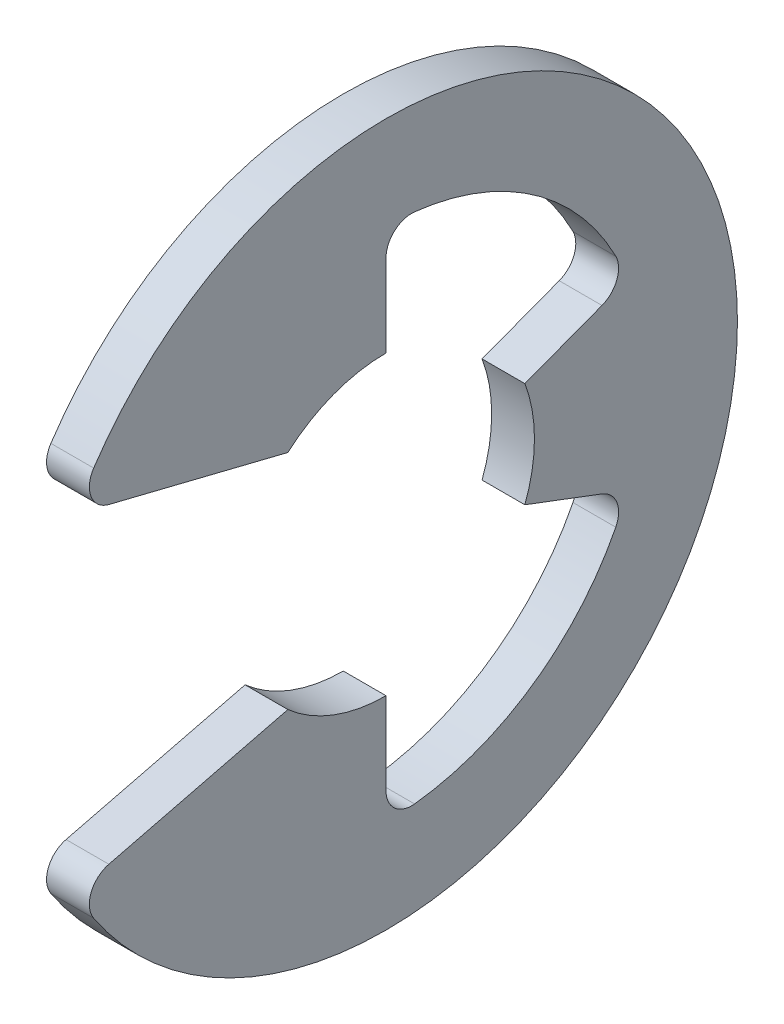
ISO-10303-21;
HEADER;
FILE_DESCRIPTION(('STEP AP214'),'2;1');
FILE_NAME('part.step','',(''),(''),'','','');
FILE_SCHEMA(('AUTOMOTIVE_DESIGN { 1 0 10303 214 1 1 1 1 }'));
ENDSEC;
DATA;
#1=APPLICATION_CONTEXT('core data for automotive mechanical design processes');
#2=APPLICATION_PROTOCOL_DEFINITION('international standard','automotive_design',2000,#1);
#3=PRODUCT_CONTEXT('',#1,'mechanical');
#4=PRODUCT('Part','Part','',(#3));
#5=PRODUCT_RELATED_PRODUCT_CATEGORY('part','',(#4));
#6=PRODUCT_DEFINITION_FORMATION('','',#4);
#7=PRODUCT_DEFINITION_CONTEXT('part definition',#1,'design');
#8=PRODUCT_DEFINITION('design','',#6,#7);
#9=PRODUCT_DEFINITION_SHAPE('','',#8);
#10=(LENGTH_UNIT() NAMED_UNIT(*) SI_UNIT(.MILLI.,.METRE.));
#11=(NAMED_UNIT(*) PLANE_ANGLE_UNIT() SI_UNIT($,.RADIAN.));
#12=(NAMED_UNIT(*) SI_UNIT($,.STERADIAN.) SOLID_ANGLE_UNIT());
#13=UNCERTAINTY_MEASURE_WITH_UNIT(LENGTH_MEASURE(1.E-05),#10,'distance_accuracy_value','');
#14=(GEOMETRIC_REPRESENTATION_CONTEXT(3) GLOBAL_UNCERTAINTY_ASSIGNED_CONTEXT((#13)) GLOBAL_UNIT_ASSIGNED_CONTEXT((#10,
#11,#12)) REPRESENTATION_CONTEXT('',''));
#15=CARTESIAN_POINT('',(0.,0.,0.));
#16=DIRECTION('',(0.,0.,1.));
#17=DIRECTION('',(1.,0.,0.));
#18=AXIS2_PLACEMENT_3D('',#15,#16,#17);
#19=CARTESIAN_POINT('',(0.6,0.,0.));
#20=DIRECTION('',(-1.,0.,0.));
#21=DIRECTION('',(0.,0.,1.));
#22=AXIS2_PLACEMENT_3D('',#19,#20,#21);
#23=CYLINDRICAL_SURFACE('',#22,9.85);
#24=CARTESIAN_POINT('',(0.6,0.,0.));
#25=DIRECTION('',(1.,0.,0.));
#26=DIRECTION('',(0.,0.,-1.));
#27=AXIS2_PLACEMENT_3D('',#24,#25,#26);
#28=CIRCLE('',#27,9.85);
#29=CARTESIAN_POINT('',(0.6,-5.46408430032092,8.19550381361552));
#30=VERTEX_POINT('',#29);
#31=CARTESIAN_POINT('',(0.6,5.46408430032092,8.19550381361552));
#32=VERTEX_POINT('',#31);
#33=EDGE_CURVE('E170',#30,#32,#28,.T.);
#34=ORIENTED_EDGE('',*,*,#33,.F.);
#35=DIRECTION('',(-1.,0.,0.));
#36=VECTOR('',#35,1.);
#37=CARTESIAN_POINT('',(0.6,-5.46408430032092,8.19550381361552));
#38=LINE('',#37,#36);
#39=CARTESIAN_POINT('',(-0.6,-5.46408430032092,8.19550381361552));
#40=VERTEX_POINT('',#39);
#41=EDGE_CURVE('E264',#30,#40,#38,.T.);
#42=ORIENTED_EDGE('',*,*,#41,.T.);
#43=CARTESIAN_POINT('',(-0.6,0.,0.));
#44=DIRECTION('',(1.,0.,0.));
#45=DIRECTION('',(0.,0.,-1.));
#46=AXIS2_PLACEMENT_3D('',#43,#44,#45);
#47=CIRCLE('',#46,9.85);
#48=CARTESIAN_POINT('',(-0.6,5.46408430032092,8.19550381361552));
#49=VERTEX_POINT('',#48);
#50=EDGE_CURVE('E208',#40,#49,#47,.T.);
#51=ORIENTED_EDGE('',*,*,#50,.T.);
#52=DIRECTION('',(-1.,0.,0.));
#53=VECTOR('',#52,1.);
#54=CARTESIAN_POINT('',(0.6,5.46408430032092,8.19550381361552));
#55=LINE('',#54,#53);
#56=EDGE_CURVE('E262',#49,#32,#55,.F.);
#57=ORIENTED_EDGE('',*,*,#56,.T.);
#58=EDGE_LOOP('',(#34,#42,#51,#57));
#59=FACE_BOUND('',#58,.T.);
#60=ADVANCED_FACE('F32',(#59),#23,.T.);
#61=CARTESIAN_POINT('',(0.6,4.59934516724939,8.7102539591277));
#62=DIRECTION('',(0.,0.970536829925373,-0.240952820606873));
#63=DIRECTION('',(0.,0.240952820606873,0.970536829925373));
#64=AXIS2_PLACEMENT_3D('',#61,#62,#63);
#65=PLANE('',#64);
#66=DIRECTION('',(0.,-0.240952820606873,-0.970536829925373));
#67=VECTOR('',#66,1.);
#68=CARTESIAN_POINT('',(0.6,4.59934516724939,8.7102539591277));
#69=LINE('',#68,#67);
#70=CARTESIAN_POINT('',(0.6,4.36589263594916,7.76992763675671));
#71=VERTEX_POINT('',#70);
#72=CARTESIAN_POINT('',(0.6,3.12,2.75158136350718));
#73=VERTEX_POINT('',#72);
#74=EDGE_CURVE('E156',#71,#73,#69,.T.);
#75=ORIENTED_EDGE('',*,*,#74,.F.);
#76=DIRECTION('',(-1.,0.,0.));
#77=VECTOR('',#76,1.);
#78=CARTESIAN_POINT('',(0.6,4.36589263594916,7.76992763675671));
#79=LINE('',#78,#77);
#80=CARTESIAN_POINT('',(-0.6,4.36589263594916,7.76992763675671));
#81=VERTEX_POINT('',#80);
#82=EDGE_CURVE('E276',#71,#81,#79,.T.);
#83=ORIENTED_EDGE('',*,*,#82,.T.);
#84=DIRECTION('',(0.,-0.240952820606873,-0.970536829925373));
#85=VECTOR('',#84,1.);
#86=CARTESIAN_POINT('',(-0.6,4.59934516724939,8.7102539591277));
#87=LINE('',#86,#85);
#88=CARTESIAN_POINT('',(-0.6,3.12,2.75158136350718));
#89=VERTEX_POINT('',#88);
#90=EDGE_CURVE('E176',#81,#89,#87,.T.);
#91=ORIENTED_EDGE('',*,*,#90,.T.);
#92=DIRECTION('',(-1.,0.,0.));
#93=VECTOR('',#92,1.);
#94=CARTESIAN_POINT('',(0.6,3.12,2.75158136350718));
#95=LINE('',#94,#93);
#96=EDGE_CURVE('E173',#73,#89,#95,.T.);
#97=ORIENTED_EDGE('',*,*,#96,.F.);
#98=EDGE_LOOP('',(#75,#83,#91,#97));
#99=FACE_BOUND('',#98,.T.);
#100=ADVANCED_FACE('F174',(#99),#65,.F.);
#101=CARTESIAN_POINT('',(0.6,0.,0.));
#102=DIRECTION('',(-1.,0.,0.));
#103=DIRECTION('',(0.,0.,1.));
#104=AXIS2_PLACEMENT_3D('',#101,#102,#103);
#105=CYLINDRICAL_SURFACE('',#104,4.16);
#106=CARTESIAN_POINT('',(-0.6,0.,0.));
#107=DIRECTION('',(-1.,0.,0.));
#108=DIRECTION('',(0.,0.,1.));
#109=AXIS2_PLACEMENT_3D('',#106,#107,#108);
#110=CIRCLE('',#109,4.16);
#111=CARTESIAN_POINT('',(-0.6,4.16,0.));
#112=VERTEX_POINT('',#111);
#113=EDGE_CURVE('E212',#89,#112,#110,.T.);
#114=ORIENTED_EDGE('',*,*,#113,.T.);
#115=DIRECTION('',(-1.,0.,0.));
#116=VECTOR('',#115,1.);
#117=CARTESIAN_POINT('',(0.6,4.16,0.));
#118=LINE('',#117,#116);
#119=CARTESIAN_POINT('',(0.6,4.16,0.));
#120=VERTEX_POINT('',#119);
#121=EDGE_CURVE('E180',#120,#112,#118,.T.);
#122=ORIENTED_EDGE('',*,*,#121,.F.);
#123=CARTESIAN_POINT('',(0.6,0.,0.));
#124=DIRECTION('',(-1.,0.,0.));
#125=DIRECTION('',(0.,0.,1.));
#126=AXIS2_PLACEMENT_3D('',#123,#124,#125);
#127=CIRCLE('',#126,4.16);
#128=EDGE_CURVE('E162',#73,#120,#127,.T.);
#129=ORIENTED_EDGE('',*,*,#128,.F.);
#130=ORIENTED_EDGE('',*,*,#96,.T.);
#131=EDGE_LOOP('',(#114,#122,#129,#130));
#132=FACE_BOUND('',#131,.T.);
#133=ADVANCED_FACE('F182',(#132),#105,.F.);
#134=CARTESIAN_POINT('',(0.6,4.16,0.));
#135=DIRECTION('',(0.,0.,1.));
#136=DIRECTION('',(0.,-1.,0.));
#137=AXIS2_PLACEMENT_3D('',#134,#135,#136);
#138=PLANE('',#137);
#139=DIRECTION('',(0.,1.,0.));
#140=VECTOR('',#139,1.);
#141=CARTESIAN_POINT('',(-0.6,4.16,0.));
#142=LINE('',#141,#140);
#143=CARTESIAN_POINT('',(-0.6,6.4710355381905,0.));
#144=VERTEX_POINT('',#143);
#145=EDGE_CURVE('E214',#112,#144,#142,.T.);
#146=ORIENTED_EDGE('',*,*,#145,.T.);
#147=DIRECTION('',(1.,0.,0.));
#148=VECTOR('',#147,1.);
#149=CARTESIAN_POINT('',(0.6,6.4710355381905,0.));
#150=LINE('',#149,#148);
#151=CARTESIAN_POINT('',(0.6,6.4710355381905,0.));
#152=VERTEX_POINT('',#151);
#153=EDGE_CURVE('E260',#144,#152,#150,.T.);
#154=ORIENTED_EDGE('',*,*,#153,.T.);
#155=DIRECTION('',(0.,1.,0.));
#156=VECTOR('',#155,1.);
#157=CARTESIAN_POINT('',(0.6,4.16,0.));
#158=LINE('',#157,#156);
#159=EDGE_CURVE('E185',#120,#152,#158,.T.);
#160=ORIENTED_EDGE('',*,*,#159,.F.);
#161=ORIENTED_EDGE('',*,*,#121,.T.);
#162=EDGE_LOOP('',(#146,#154,#160,#161));
#163=FACE_BOUND('',#162,.T.);
#164=ADVANCED_FACE('F382',(#163),#138,.F.);
#165=CARTESIAN_POINT('',(0.6,0.,0.));
#166=DIRECTION('',(-1.,0.,0.));
#167=DIRECTION('',(0.,0.,1.));
#168=AXIS2_PLACEMENT_3D('',#165,#166,#167);
#169=CYLINDRICAL_SURFACE('',#168,7.23096774193548);
#170=CARTESIAN_POINT('',(0.6,0.,0.));
#171=DIRECTION('',(-1.,0.,0.));
#172=DIRECTION('',(0.,0.,-1.));
#173=AXIS2_PLACEMENT_3D('',#170,#171,#172);
#174=CIRCLE('',#173,7.23096774193548);
#175=CARTESIAN_POINT('',(0.6,7.18661972969076,-0.799619500594528));
#176=VERTEX_POINT('',#175);
#177=CARTESIAN_POINT('',(0.6,3.28882932508869,-6.4397590137635));
#178=VERTEX_POINT('',#177);
#179=EDGE_CURVE('E187',#176,#178,#174,.T.);
#180=ORIENTED_EDGE('',*,*,#179,.F.);
#181=DIRECTION('',(-1.,0.,0.));
#182=VECTOR('',#181,1.);
#183=CARTESIAN_POINT('',(0.6,7.18661972969076,-0.799619500594528));
#184=LINE('',#183,#182);
#185=CARTESIAN_POINT('',(-0.6,7.18661972969076,-0.799619500594528));
#186=VERTEX_POINT('',#185);
#187=EDGE_CURVE('E257',#176,#186,#184,.T.);
#188=ORIENTED_EDGE('',*,*,#187,.T.);
#189=CARTESIAN_POINT('',(-0.6,0.,0.));
#190=DIRECTION('',(-1.,0.,0.));
#191=DIRECTION('',(0.,0.,-1.));
#192=AXIS2_PLACEMENT_3D('',#189,#190,#191);
#193=CIRCLE('',#192,7.23096774193548);
#194=CARTESIAN_POINT('',(-0.6,3.28882932508869,-6.4397590137635));
#195=VERTEX_POINT('',#194);
#196=EDGE_CURVE('E217',#186,#195,#193,.T.);
#197=ORIENTED_EDGE('',*,*,#196,.T.);
#198=DIRECTION('',(-1.,0.,0.));
#199=VECTOR('',#198,1.);
#200=CARTESIAN_POINT('',(0.6,3.28882932508869,-6.4397590137635));
#201=LINE('',#200,#199);
#202=EDGE_CURVE('E255',#195,#178,#201,.F.);
#203=ORIENTED_EDGE('',*,*,#202,.T.);
#204=EDGE_LOOP('',(#180,#188,#197,#203));
#205=FACE_BOUND('',#204,.T.);
#206=ADVANCED_FACE('F304',(#205),#169,.F.);
#207=CARTESIAN_POINT('',(0.6,1.47078210486802,-3.8913236822449));
#208=DIRECTION('',(0.,-0.935414346693485,-0.353553390593275));
#209=DIRECTION('',(0.,0.353553390593275,-0.935414346693485));
#210=AXIS2_PLACEMENT_3D('',#207,#208,#209);
#211=PLANE('',#210);
#212=DIRECTION('',(0.,-0.353553390593275,0.935414346693485));
#213=VECTOR('',#212,1.);
#214=CARTESIAN_POINT('',(0.6,1.47078210486802,-3.8913236822449));
#215=LINE('',#214,#213);
#216=CARTESIAN_POINT('',(0.6,2.28785655517683,-6.0530994803868));
#217=VERTEX_POINT('',#216);
#218=CARTESIAN_POINT('',(0.6,1.47078210486802,-3.8913236822449));
#219=VERTEX_POINT('',#218);
#220=EDGE_CURVE('E192',#217,#219,#215,.T.);
#221=ORIENTED_EDGE('',*,*,#220,.F.);
#222=DIRECTION('',(1.,0.,0.));
#223=VECTOR('',#222,1.);
#224=CARTESIAN_POINT('',(-0.6,2.28785655517683,-6.0530994803868));
#225=LINE('',#224,#223);
#226=CARTESIAN_POINT('',(-0.6,2.28785655517683,-6.0530994803868));
#227=VERTEX_POINT('',#226);
#228=EDGE_CURVE('E279',#217,#227,#225,.F.);
#229=ORIENTED_EDGE('',*,*,#228,.T.);
#230=DIRECTION('',(0.,-0.353553390593275,0.935414346693485));
#231=VECTOR('',#230,1.);
#232=CARTESIAN_POINT('',(-0.6,1.47078210486802,-3.8913236822449));
#233=LINE('',#232,#231);
#234=CARTESIAN_POINT('',(-0.6,1.47078210486802,-3.8913236822449));
#235=VERTEX_POINT('',#234);
#236=EDGE_CURVE('E220',#227,#235,#233,.T.);
#237=ORIENTED_EDGE('',*,*,#236,.T.);
#238=DIRECTION('',(-1.,0.,0.));
#239=VECTOR('',#238,1.);
#240=CARTESIAN_POINT('',(0.6,1.47078210486802,-3.8913236822449));
#241=LINE('',#240,#239);
#242=EDGE_CURVE('E244',#219,#235,#241,.T.);
#243=ORIENTED_EDGE('',*,*,#242,.F.);
#244=EDGE_LOOP('',(#221,#229,#237,#243));
#245=FACE_BOUND('',#244,.T.);
#246=ADVANCED_FACE('F307',(#245),#211,.F.);
#247=CARTESIAN_POINT('',(0.6,0.,0.));
#248=DIRECTION('',(-1.,0.,0.));
#249=DIRECTION('',(0.,0.,1.));
#250=AXIS2_PLACEMENT_3D('',#247,#248,#249);
#251=CYLINDRICAL_SURFACE('',#250,4.16);
#252=CARTESIAN_POINT('',(-0.6,0.,0.));
#253=DIRECTION('',(-1.,0.,0.));
#254=DIRECTION('',(0.,0.,1.));
#255=AXIS2_PLACEMENT_3D('',#252,#253,#254);
#256=CIRCLE('',#255,4.16);
#257=CARTESIAN_POINT('',(-0.6,-1.47078210486802,-3.8913236822449));
#258=VERTEX_POINT('',#257);
#259=EDGE_CURVE('E222',#235,#258,#256,.T.);
#260=ORIENTED_EDGE('',*,*,#259,.T.);
#261=DIRECTION('',(-1.,0.,0.));
#262=VECTOR('',#261,1.);
#263=CARTESIAN_POINT('',(0.6,-1.47078210486802,-3.8913236822449));
#264=LINE('',#263,#262);
#265=CARTESIAN_POINT('',(0.6,-1.47078210486802,-3.8913236822449));
#266=VERTEX_POINT('',#265);
#267=EDGE_CURVE('E241',#266,#258,#264,.T.);
#268=ORIENTED_EDGE('',*,*,#267,.F.);
#269=CARTESIAN_POINT('',(0.6,0.,0.));
#270=DIRECTION('',(-1.,0.,0.));
#271=DIRECTION('',(0.,0.,1.));
#272=AXIS2_PLACEMENT_3D('',#269,#270,#271);
#273=CIRCLE('',#272,4.16);
#274=EDGE_CURVE('E194',#219,#266,#273,.T.);
#275=ORIENTED_EDGE('',*,*,#274,.F.);
#276=ORIENTED_EDGE('',*,*,#242,.T.);
#277=EDGE_LOOP('',(#260,#268,#275,#276));
#278=FACE_BOUND('',#277,.T.);
#279=ADVANCED_FACE('F313',(#278),#251,.F.);
#280=CARTESIAN_POINT('',(0.6,-1.47078210486802,-3.8913236822449));
#281=DIRECTION('',(0.,0.935414346693485,-0.353553390593275));
#282=DIRECTION('',(0.,0.353553390593275,0.935414346693485));
#283=AXIS2_PLACEMENT_3D('',#280,#281,#282);
#284=PLANE('',#283);
#285=DIRECTION('',(0.,-0.353553390593274,-0.935414346693485));
#286=VECTOR('',#285,1.);
#287=CARTESIAN_POINT('',(-0.6,-1.47078210486802,-3.8913236822449));
#288=LINE('',#287,#286);
#289=CARTESIAN_POINT('',(-0.6,-2.28785655517682,-6.0530994803868));
#290=VERTEX_POINT('',#289);
#291=EDGE_CURVE('E224',#258,#290,#288,.T.);
#292=ORIENTED_EDGE('',*,*,#291,.T.);
#293=DIRECTION('',(1.,0.,0.));
#294=VECTOR('',#293,1.);
#295=CARTESIAN_POINT('',(0.6,-2.28785655517682,-6.0530994803868));
#296=LINE('',#295,#294);
#297=CARTESIAN_POINT('',(0.6,-2.28785655517682,-6.0530994803868));
#298=VERTEX_POINT('',#297);
#299=EDGE_CURVE('E47',#290,#298,#296,.T.);
#300=ORIENTED_EDGE('',*,*,#299,.T.);
#301=DIRECTION('',(0.,-0.353553390593274,-0.935414346693485));
#302=VECTOR('',#301,1.);
#303=CARTESIAN_POINT('',(0.6,-1.47078210486802,-3.8913236822449));
#304=LINE('',#303,#302);
#305=EDGE_CURVE('E196',#266,#298,#304,.T.);
#306=ORIENTED_EDGE('',*,*,#305,.F.);
#307=ORIENTED_EDGE('',*,*,#267,.T.);
#308=EDGE_LOOP('',(#292,#300,#306,#307));
#309=FACE_BOUND('',#308,.T.);
#310=ADVANCED_FACE('F315',(#309),#284,.F.);
#311=CARTESIAN_POINT('',(0.6,0.,0.));
#312=DIRECTION('',(-1.,0.,0.));
#313=DIRECTION('',(0.,0.,1.));
#314=AXIS2_PLACEMENT_3D('',#311,#312,#313);
#315=CYLINDRICAL_SURFACE('',#314,7.23096774193548);
#316=CARTESIAN_POINT('',(-0.6,0.,0.));
#317=DIRECTION('',(-1.,0.,0.));
#318=DIRECTION('',(0.,0.,-1.));
#319=AXIS2_PLACEMENT_3D('',#316,#317,#318);
#320=CIRCLE('',#319,7.23096774193548);
#321=CARTESIAN_POINT('',(-0.6,-3.28882932508869,-6.4397590137635));
#322=VERTEX_POINT('',#321);
#323=CARTESIAN_POINT('',(-0.6,-7.18661972969076,-0.799619500594529));
#324=VERTEX_POINT('',#323);
#325=EDGE_CURVE('E226',#322,#324,#320,.T.);
#326=ORIENTED_EDGE('',*,*,#325,.T.);
#327=DIRECTION('',(-1.,0.,0.));
#328=VECTOR('',#327,1.);
#329=CARTESIAN_POINT('',(0.6,-7.18661972969076,-0.799619500594529));
#330=LINE('',#329,#328);
#331=CARTESIAN_POINT('',(0.6,-7.18661972969076,-0.799619500594529));
#332=VERTEX_POINT('',#331);
#333=EDGE_CURVE('E253',#324,#332,#330,.F.);
#334=ORIENTED_EDGE('',*,*,#333,.T.);
#335=CARTESIAN_POINT('',(0.6,0.,0.));
#336=DIRECTION('',(-1.,0.,0.));
#337=DIRECTION('',(0.,0.,-1.));
#338=AXIS2_PLACEMENT_3D('',#335,#336,#337);
#339=CIRCLE('',#338,7.23096774193548);
#340=CARTESIAN_POINT('',(0.6,-3.28882932508869,-6.4397590137635));
#341=VERTEX_POINT('',#340);
#342=EDGE_CURVE('E198',#341,#332,#339,.T.);
#343=ORIENTED_EDGE('',*,*,#342,.F.);
#344=DIRECTION('',(-1.,0.,0.));
#345=VECTOR('',#344,1.);
#346=CARTESIAN_POINT('',(0.6,-3.28882932508869,-6.4397590137635));
#347=LINE('',#346,#345);
#348=EDGE_CURVE('E250',#341,#322,#347,.T.);
#349=ORIENTED_EDGE('',*,*,#348,.T.);
#350=EDGE_LOOP('',(#326,#334,#343,#349));
#351=FACE_BOUND('',#350,.T.);
#352=ADVANCED_FACE('F317',(#351),#315,.F.);
#353=CARTESIAN_POINT('',(0.6,-4.16,0.));
#354=DIRECTION('',(0.,0.,1.));
#355=DIRECTION('',(0.,-1.,0.));
#356=AXIS2_PLACEMENT_3D('',#353,#354,#355);
#357=PLANE('',#356);
#358=DIRECTION('',(0.,1.,0.));
#359=VECTOR('',#358,1.);
#360=CARTESIAN_POINT('',(0.6,-4.16,0.));
#361=LINE('',#360,#359);
#362=CARTESIAN_POINT('',(0.6,-6.4710355381905,0.));
#363=VERTEX_POINT('',#362);
#364=CARTESIAN_POINT('',(0.6,-4.16,0.));
#365=VERTEX_POINT('',#364);
#366=EDGE_CURVE('E201',#363,#365,#361,.T.);
#367=ORIENTED_EDGE('',*,*,#366,.F.);
#368=DIRECTION('',(1.,0.,0.));
#369=VECTOR('',#368,1.);
#370=CARTESIAN_POINT('',(-0.6,-6.4710355381905,0.));
#371=LINE('',#370,#369);
#372=CARTESIAN_POINT('',(-0.6,-6.4710355381905,0.));
#373=VERTEX_POINT('',#372);
#374=EDGE_CURVE('E179',#363,#373,#371,.F.);
#375=ORIENTED_EDGE('',*,*,#374,.T.);
#376=DIRECTION('',(0.,1.,0.));
#377=VECTOR('',#376,1.);
#378=CARTESIAN_POINT('',(-0.6,-4.16,0.));
#379=LINE('',#378,#377);
#380=CARTESIAN_POINT('',(-0.6,-4.16,0.));
#381=VERTEX_POINT('',#380);
#382=EDGE_CURVE('E229',#373,#381,#379,.T.);
#383=ORIENTED_EDGE('',*,*,#382,.T.);
#384=DIRECTION('',(-1.,0.,0.));
#385=VECTOR('',#384,1.);
#386=CARTESIAN_POINT('',(0.6,-4.16,0.));
#387=LINE('',#386,#385);
#388=EDGE_CURVE('E238',#365,#381,#387,.T.);
#389=ORIENTED_EDGE('',*,*,#388,.F.);
#390=EDGE_LOOP('',(#367,#375,#383,#389));
#391=FACE_BOUND('',#390,.T.);
#392=ADVANCED_FACE('F323',(#391),#357,.F.);
#393=CARTESIAN_POINT('',(0.6,0.,0.));
#394=DIRECTION('',(-1.,0.,0.));
#395=DIRECTION('',(0.,0.,1.));
#396=AXIS2_PLACEMENT_3D('',#393,#394,#395);
#397=CYLINDRICAL_SURFACE('',#396,4.16);
#398=CARTESIAN_POINT('',(-0.6,0.,0.));
#399=DIRECTION('',(-1.,0.,0.));
#400=DIRECTION('',(0.,0.,-1.));
#401=AXIS2_PLACEMENT_3D('',#398,#399,#400);
#402=CIRCLE('',#401,4.16);
#403=CARTESIAN_POINT('',(-0.6,-3.12,2.75158136350717));
#404=VERTEX_POINT('',#403);
#405=EDGE_CURVE('E231',#381,#404,#402,.T.);
#406=ORIENTED_EDGE('',*,*,#405,.T.);
#407=DIRECTION('',(-1.,0.,0.));
#408=VECTOR('',#407,1.);
#409=CARTESIAN_POINT('',(0.6,-3.12,2.75158136350717));
#410=LINE('',#409,#408);
#411=CARTESIAN_POINT('',(0.6,-3.12,2.75158136350717));
#412=VERTEX_POINT('',#411);
#413=EDGE_CURVE('E207',#412,#404,#410,.T.);
#414=ORIENTED_EDGE('',*,*,#413,.F.);
#415=CARTESIAN_POINT('',(0.6,0.,0.));
#416=DIRECTION('',(-1.,0.,0.));
#417=DIRECTION('',(0.,0.,-1.));
#418=AXIS2_PLACEMENT_3D('',#415,#416,#417);
#419=CIRCLE('',#418,4.16);
#420=EDGE_CURVE('E203',#365,#412,#419,.T.);
#421=ORIENTED_EDGE('',*,*,#420,.F.);
#422=ORIENTED_EDGE('',*,*,#388,.T.);
#423=EDGE_LOOP('',(#406,#414,#421,#422));
#424=FACE_BOUND('',#423,.T.);
#425=ADVANCED_FACE('F372',(#424),#397,.F.);
#426=CARTESIAN_POINT('',(0.6,-4.59934516724939,8.7102539591277));
#427=DIRECTION('',(0.,-0.970536829925373,-0.240952820606873));
#428=DIRECTION('',(0.,0.240952820606873,-0.970536829925373));
#429=AXIS2_PLACEMENT_3D('',#426,#427,#428);
#430=PLANE('',#429);
#431=DIRECTION('',(0.,-0.240952820606873,0.970536829925373));
#432=VECTOR('',#431,1.);
#433=CARTESIAN_POINT('',(-0.6,-4.59934516724939,8.7102539591277));
#434=LINE('',#433,#432);
#435=CARTESIAN_POINT('',(-0.6,-4.36589263594916,7.76992763675671));
#436=VERTEX_POINT('',#435);
#437=EDGE_CURVE('E233',#404,#436,#434,.T.);
#438=ORIENTED_EDGE('',*,*,#437,.T.);
#439=DIRECTION('',(-1.,0.,0.));
#440=VECTOR('',#439,1.);
#441=CARTESIAN_POINT('',(0.6,-4.36589263594916,7.76992763675671));
#442=LINE('',#441,#440);
#443=CARTESIAN_POINT('',(0.6,-4.36589263594916,7.76992763675671));
#444=VERTEX_POINT('',#443);
#445=EDGE_CURVE('E271',#436,#444,#442,.F.);
#446=ORIENTED_EDGE('',*,*,#445,.T.);
#447=DIRECTION('',(0.,-0.240952820606873,0.970536829925373));
#448=VECTOR('',#447,1.);
#449=CARTESIAN_POINT('',(0.6,-4.59934516724939,8.7102539591277));
#450=LINE('',#449,#448);
#451=EDGE_CURVE('E205',#412,#444,#450,.T.);
#452=ORIENTED_EDGE('',*,*,#451,.F.);
#453=ORIENTED_EDGE('',*,*,#413,.T.);
#454=EDGE_LOOP('',(#438,#446,#452,#453));
#455=FACE_BOUND('',#454,.T.);
#456=ADVANCED_FACE('F414',(#455),#430,.F.);
#457=CARTESIAN_POINT('',(0.6,0.,0.));
#458=DIRECTION('',(1.,0.,0.));
#459=DIRECTION('',(0.,0.,-1.));
#460=AXIS2_PLACEMENT_3D('',#457,#458,#459);
#461=PLANE('',#460);
#462=ORIENTED_EDGE('',*,*,#451,.T.);
#463=CARTESIAN_POINT('',(0.6,-5.06467915349543,7.59644160591976));
#464=DIRECTION('',(1.,0.,0.));
#465=DIRECTION('',(0.,0.,-1.));
#466=AXIS2_PLACEMENT_3D('',#463,#464,#465);
#467=CIRCLE('',#466,0.72);
#468=EDGE_CURVE('E274',#444,#30,#467,.T.);
#469=ORIENTED_EDGE('',*,*,#468,.T.);
#470=ORIENTED_EDGE('',*,*,#33,.T.);
#471=CARTESIAN_POINT('',(0.6,5.06467915349543,7.59644160591976));
#472=DIRECTION('',(1.,0.,0.));
#473=DIRECTION('',(0.,0.,-1.));
#474=AXIS2_PLACEMENT_3D('',#471,#472,#473);
#475=CIRCLE('',#474,0.72);
#476=EDGE_CURVE('E166',#32,#71,#475,.T.);
#477=ORIENTED_EDGE('',*,*,#476,.T.);
#478=ORIENTED_EDGE('',*,*,#74,.T.);
#479=ORIENTED_EDGE('',*,*,#128,.T.);
#480=ORIENTED_EDGE('',*,*,#159,.T.);
#481=CARTESIAN_POINT('',(0.6,6.4710355381905,-0.719999999999998));
#482=DIRECTION('',(1.,0.,0.));
#483=DIRECTION('',(0.,0.,-1.));
#484=AXIS2_PLACEMENT_3D('',#481,#482,#483);
#485=CIRCLE('',#484,0.72);
#486=EDGE_CURVE('E288',#152,#176,#485,.F.);
#487=ORIENTED_EDGE('',*,*,#486,.T.);
#488=ORIENTED_EDGE('',*,*,#179,.T.);
#489=CARTESIAN_POINT('',(0.6,2.96135488479613,-5.79854103915964));
#490=DIRECTION('',(1.,0.,0.));
#491=DIRECTION('',(0.,0.,-1.));
#492=AXIS2_PLACEMENT_3D('',#489,#490,#491);
#493=CIRCLE('',#492,0.72);
#494=EDGE_CURVE('E11',#178,#217,#493,.F.);
#495=ORIENTED_EDGE('',*,*,#494,.T.);
#496=ORIENTED_EDGE('',*,*,#220,.T.);
#497=ORIENTED_EDGE('',*,*,#274,.T.);
#498=ORIENTED_EDGE('',*,*,#305,.T.);
#499=CARTESIAN_POINT('',(0.6,-2.96135488479613,-5.79854103915964));
#500=DIRECTION('',(1.,0.,0.));
#501=DIRECTION('',(0.,0.,-1.));
#502=AXIS2_PLACEMENT_3D('',#499,#500,#501);
#503=CIRCLE('',#502,0.72);
#504=EDGE_CURVE('E292',#298,#341,#503,.F.);
#505=ORIENTED_EDGE('',*,*,#504,.T.);
#506=ORIENTED_EDGE('',*,*,#342,.T.);
#507=CARTESIAN_POINT('',(0.6,-6.4710355381905,-0.719999999999999));
#508=DIRECTION('',(1.,0.,0.));
#509=DIRECTION('',(0.,0.,-1.));
#510=AXIS2_PLACEMENT_3D('',#507,#508,#509);
#511=CIRCLE('',#510,0.72);
#512=EDGE_CURVE('E284',#332,#363,#511,.F.);
#513=ORIENTED_EDGE('',*,*,#512,.T.);
#514=ORIENTED_EDGE('',*,*,#366,.T.);
#515=ORIENTED_EDGE('',*,*,#420,.T.);
#516=EDGE_LOOP('',(#462,#469,#470,#477,#478,#479,#480,#487,#488,#495,#496,#497,#498,#505,#506,
#513,#514,#515));
#517=FACE_BOUND('',#516,.T.);
#518=ADVANCED_FACE('F159',(#517),#461,.T.);
#519=CARTESIAN_POINT('',(-0.6,0.,0.));
#520=DIRECTION('',(1.,0.,0.));
#521=DIRECTION('',(0.,0.,-1.));
#522=AXIS2_PLACEMENT_3D('',#519,#520,#521);
#523=PLANE('',#522);
#524=ORIENTED_EDGE('',*,*,#50,.F.);
#525=CARTESIAN_POINT('',(-0.6,-5.06467915349543,7.59644160591976));
#526=DIRECTION('',(1.,0.,0.));
#527=DIRECTION('',(0.,0.,-1.));
#528=AXIS2_PLACEMENT_3D('',#525,#526,#527);
#529=CIRCLE('',#528,0.72);
#530=EDGE_CURVE('E269',#40,#436,#529,.F.);
#531=ORIENTED_EDGE('',*,*,#530,.T.);
#532=ORIENTED_EDGE('',*,*,#437,.F.);
#533=ORIENTED_EDGE('',*,*,#405,.F.);
#534=ORIENTED_EDGE('',*,*,#382,.F.);
#535=CARTESIAN_POINT('',(-0.6,-6.4710355381905,-0.719999999999999));
#536=DIRECTION('',(1.,0.,0.));
#537=DIRECTION('',(0.,0.,-1.));
#538=AXIS2_PLACEMENT_3D('',#535,#536,#537);
#539=CIRCLE('',#538,0.72);
#540=EDGE_CURVE('E282',#373,#324,#539,.T.);
#541=ORIENTED_EDGE('',*,*,#540,.T.);
#542=ORIENTED_EDGE('',*,*,#325,.F.);
#543=CARTESIAN_POINT('',(-0.6,-2.96135488479613,-5.79854103915964));
#544=DIRECTION('',(1.,0.,0.));
#545=DIRECTION('',(0.,0.,-1.));
#546=AXIS2_PLACEMENT_3D('',#543,#544,#545);
#547=CIRCLE('',#546,0.72);
#548=EDGE_CURVE('E290',#322,#290,#547,.T.);
#549=ORIENTED_EDGE('',*,*,#548,.T.);
#550=ORIENTED_EDGE('',*,*,#291,.F.);
#551=ORIENTED_EDGE('',*,*,#259,.F.);
#552=ORIENTED_EDGE('',*,*,#236,.F.);
#553=CARTESIAN_POINT('',(-0.6,2.96135488479613,-5.79854103915964));
#554=DIRECTION('',(1.,0.,0.));
#555=DIRECTION('',(0.,0.,-1.));
#556=AXIS2_PLACEMENT_3D('',#553,#554,#555);
#557=CIRCLE('',#556,0.72);
#558=EDGE_CURVE('E40',#227,#195,#557,.T.);
#559=ORIENTED_EDGE('',*,*,#558,.T.);
#560=ORIENTED_EDGE('',*,*,#196,.F.);
#561=CARTESIAN_POINT('',(-0.6,6.4710355381905,-0.719999999999998));
#562=DIRECTION('',(1.,0.,0.));
#563=DIRECTION('',(0.,0.,-1.));
#564=AXIS2_PLACEMENT_3D('',#561,#562,#563);
#565=CIRCLE('',#564,0.72);
#566=EDGE_CURVE('E286',#186,#144,#565,.T.);
#567=ORIENTED_EDGE('',*,*,#566,.T.);
#568=ORIENTED_EDGE('',*,*,#145,.F.);
#569=ORIENTED_EDGE('',*,*,#113,.F.);
#570=ORIENTED_EDGE('',*,*,#90,.F.);
#571=CARTESIAN_POINT('',(-0.6,5.06467915349543,7.59644160591976));
#572=DIRECTION('',(1.,0.,0.));
#573=DIRECTION('',(0.,0.,-1.));
#574=AXIS2_PLACEMENT_3D('',#571,#572,#573);
#575=CIRCLE('',#574,0.72);
#576=EDGE_CURVE('E267',#81,#49,#575,.F.);
#577=ORIENTED_EDGE('',*,*,#576,.T.);
#578=EDGE_LOOP('',(#524,#531,#532,#533,#534,#541,#542,#549,#550,#551,#552,#559,#560,#567,#568,
#569,#570,#577));
#579=FACE_BOUND('',#578,.T.);
#580=ADVANCED_FACE('F297',(#579),#523,.F.);
#581=CARTESIAN_POINT('',(0.6,-6.4710355381905,-0.719999999999999));
#582=DIRECTION('',(-1.,0.,0.));
#583=DIRECTION('',(0.,0.,1.));
#584=AXIS2_PLACEMENT_3D('',#581,#582,#583);
#585=CYLINDRICAL_SURFACE('',#584,0.72);
#586=ORIENTED_EDGE('',*,*,#512,.F.);
#587=ORIENTED_EDGE('',*,*,#333,.F.);
#588=ORIENTED_EDGE('',*,*,#540,.F.);
#589=ORIENTED_EDGE('',*,*,#374,.F.);
#590=EDGE_LOOP('',(#586,#587,#588,#589));
#591=FACE_BOUND('',#590,.T.);
#592=ADVANCED_FACE('F337',(#591),#585,.F.);
#593=CARTESIAN_POINT('',(0.6,6.4710355381905,-0.719999999999998));
#594=DIRECTION('',(-1.,0.,0.));
#595=DIRECTION('',(0.,0.,1.));
#596=AXIS2_PLACEMENT_3D('',#593,#594,#595);
#597=CYLINDRICAL_SURFACE('',#596,0.72);
#598=ORIENTED_EDGE('',*,*,#486,.F.);
#599=ORIENTED_EDGE('',*,*,#153,.F.);
#600=ORIENTED_EDGE('',*,*,#566,.F.);
#601=ORIENTED_EDGE('',*,*,#187,.F.);
#602=EDGE_LOOP('',(#598,#599,#600,#601));
#603=FACE_BOUND('',#602,.T.);
#604=ADVANCED_FACE('F340',(#603),#597,.F.);
#605=CARTESIAN_POINT('',(0.6,-5.06467915349543,7.59644160591976));
#606=DIRECTION('',(-1.,0.,0.));
#607=DIRECTION('',(0.,0.,1.));
#608=AXIS2_PLACEMENT_3D('',#605,#606,#607);
#609=CYLINDRICAL_SURFACE('',#608,0.72);
#610=ORIENTED_EDGE('',*,*,#468,.F.);
#611=ORIENTED_EDGE('',*,*,#445,.F.);
#612=ORIENTED_EDGE('',*,*,#530,.F.);
#613=ORIENTED_EDGE('',*,*,#41,.F.);
#614=EDGE_LOOP('',(#610,#611,#612,#613));
#615=FACE_BOUND('',#614,.T.);
#616=ADVANCED_FACE('F344',(#615),#609,.T.);
#617=CARTESIAN_POINT('',(0.6,5.06467915349543,7.59644160591976));
#618=DIRECTION('',(-1.,0.,0.));
#619=DIRECTION('',(0.,0.,1.));
#620=AXIS2_PLACEMENT_3D('',#617,#618,#619);
#621=CYLINDRICAL_SURFACE('',#620,0.72);
#622=ORIENTED_EDGE('',*,*,#476,.F.);
#623=ORIENTED_EDGE('',*,*,#56,.F.);
#624=ORIENTED_EDGE('',*,*,#576,.F.);
#625=ORIENTED_EDGE('',*,*,#82,.F.);
#626=EDGE_LOOP('',(#622,#623,#624,#625));
#627=FACE_BOUND('',#626,.T.);
#628=ADVANCED_FACE('F348',(#627),#621,.T.);
#629=CARTESIAN_POINT('',(0.6,-2.96135488479613,-5.79854103915964));
#630=DIRECTION('',(-1.,0.,0.));
#631=DIRECTION('',(0.,0.,1.));
#632=AXIS2_PLACEMENT_3D('',#629,#630,#631);
#633=CYLINDRICAL_SURFACE('',#632,0.72);
#634=ORIENTED_EDGE('',*,*,#504,.F.);
#635=ORIENTED_EDGE('',*,*,#299,.F.);
#636=ORIENTED_EDGE('',*,*,#548,.F.);
#637=ORIENTED_EDGE('',*,*,#348,.F.);
#638=EDGE_LOOP('',(#634,#635,#636,#637));
#639=FACE_BOUND('',#638,.T.);
#640=ADVANCED_FACE('F351',(#639),#633,.F.);
#641=CARTESIAN_POINT('',(0.6,2.96135488479613,-5.79854103915964));
#642=DIRECTION('',(-1.,0.,0.));
#643=DIRECTION('',(0.,0.,1.));
#644=AXIS2_PLACEMENT_3D('',#641,#642,#643);
#645=CYLINDRICAL_SURFACE('',#644,0.72);
#646=ORIENTED_EDGE('',*,*,#494,.F.);
#647=ORIENTED_EDGE('',*,*,#202,.F.);
#648=ORIENTED_EDGE('',*,*,#558,.F.);
#649=ORIENTED_EDGE('',*,*,#228,.F.);
#650=EDGE_LOOP('',(#646,#647,#648,#649));
#651=FACE_BOUND('',#650,.T.);
#652=ADVANCED_FACE('F34',(#651),#645,.F.);
#653=CLOSED_SHELL('',(#60,#100,#133,#164,#206,#246,#279,#310,#352,#392,#425,#456,#518,#580,#592,
#604,#616,#628,#640,#652));
#654=MANIFOLD_SOLID_BREP('B2',#653);
#655=ADVANCED_BREP_SHAPE_REPRESENTATION('',(#18,#654),#14);
#656=SHAPE_DEFINITION_REPRESENTATION(#9,#655);
ENDSEC;
END-ISO-10303-21;
